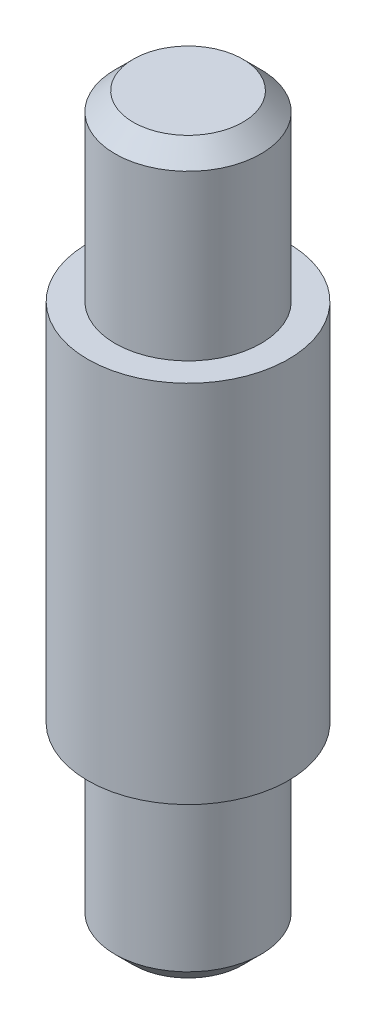
ISO-10303-21;
HEADER;
FILE_DESCRIPTION(('STEP AP214'),'2;1');
FILE_NAME('part.step','',(''),(''),'','','');
FILE_SCHEMA(('AUTOMOTIVE_DESIGN { 1 0 10303 214 1 1 1 1 }'));
ENDSEC;
DATA;
#1=APPLICATION_CONTEXT('core data for automotive mechanical design processes');
#2=APPLICATION_PROTOCOL_DEFINITION('international standard','automotive_design',2000,#1);
#3=PRODUCT_CONTEXT('',#1,'mechanical');
#4=PRODUCT('Part','Part','',(#3));
#5=PRODUCT_RELATED_PRODUCT_CATEGORY('part','',(#4));
#6=PRODUCT_DEFINITION_FORMATION('','',#4);
#7=PRODUCT_DEFINITION_CONTEXT('part definition',#1,'design');
#8=PRODUCT_DEFINITION('design','',#6,#7);
#9=PRODUCT_DEFINITION_SHAPE('','',#8);
#10=(LENGTH_UNIT() NAMED_UNIT(*) SI_UNIT(.MILLI.,.METRE.));
#11=(NAMED_UNIT(*) PLANE_ANGLE_UNIT() SI_UNIT($,.RADIAN.));
#12=(NAMED_UNIT(*) SI_UNIT($,.STERADIAN.) SOLID_ANGLE_UNIT());
#13=UNCERTAINTY_MEASURE_WITH_UNIT(LENGTH_MEASURE(1.E-05),#10,'distance_accuracy_value','');
#14=(GEOMETRIC_REPRESENTATION_CONTEXT(3) GLOBAL_UNCERTAINTY_ASSIGNED_CONTEXT((#13)) GLOBAL_UNIT_ASSIGNED_CONTEXT((#10,
#11,#12)) REPRESENTATION_CONTEXT('',''));
#15=CARTESIAN_POINT('',(0.,0.,0.));
#16=DIRECTION('',(0.,0.,1.));
#17=DIRECTION('',(1.,0.,0.));
#18=AXIS2_PLACEMENT_3D('',#15,#16,#17);
#19=CARTESIAN_POINT('',(0.,80.,0.));
#20=DIRECTION('',(0.,-1.,0.));
#21=DIRECTION('',(0.,0.,-1.));
#22=AXIS2_PLACEMENT_3D('',#19,#20,#21);
#23=CYLINDRICAL_SURFACE('',#22,8.);
#24=CARTESIAN_POINT('',(0.,78.,0.));
#25=DIRECTION('',(0.,1.,0.));
#26=DIRECTION('',(0.,0.,1.));
#27=AXIS2_PLACEMENT_3D('',#24,#25,#26);
#28=CIRCLE('',#27,8.);
#29=CARTESIAN_POINT('',(0.,78.,8.));
#30=VERTEX_POINT('',#29);
#31=EDGE_CURVE('E49',#30,#30,#28,.F.);
#32=ORIENTED_EDGE('',*,*,#31,.T.);
#33=EDGE_LOOP('',(#32));
#34=FACE_BOUND('',#33,.T.);
#35=CARTESIAN_POINT('',(0.,60.,0.));
#36=DIRECTION('',(0.,1.,0.));
#37=DIRECTION('',(0.,0.,1.));
#38=AXIS2_PLACEMENT_3D('',#35,#36,#37);
#39=CIRCLE('',#38,8.);
#40=CARTESIAN_POINT('',(0.,60.,8.));
#41=VERTEX_POINT('',#40);
#42=EDGE_CURVE('E59',#41,#41,#39,.T.);
#43=ORIENTED_EDGE('',*,*,#42,.T.);
#44=EDGE_LOOP('',(#43));
#45=FACE_BOUND('',#44,.T.);
#46=ADVANCED_FACE('F37',(#34,#45),#23,.T.);
#47=CARTESIAN_POINT('',(0.,80.,0.));
#48=DIRECTION('',(0.,1.,0.));
#49=DIRECTION('',(0.,0.,1.));
#50=AXIS2_PLACEMENT_3D('',#47,#48,#49);
#51=PLANE('',#50);
#52=CARTESIAN_POINT('',(0.,80.,0.));
#53=DIRECTION('',(0.,1.,0.));
#54=DIRECTION('',(0.,0.,1.));
#55=AXIS2_PLACEMENT_3D('',#52,#53,#54);
#56=CIRCLE('',#55,6.00000000000001);
#57=CARTESIAN_POINT('',(0.,80.,6.00000000000001));
#58=VERTEX_POINT('',#57);
#59=EDGE_CURVE('E53',#58,#58,#56,.T.);
#60=ORIENTED_EDGE('',*,*,#59,.T.);
#61=EDGE_LOOP('',(#60));
#62=FACE_BOUND('',#61,.T.);
#63=ADVANCED_FACE('F76',(#62),#51,.T.);
#64=CARTESIAN_POINT('',(0.,60.,0.));
#65=DIRECTION('',(0.,-1.,0.));
#66=DIRECTION('',(0.,0.,-1.));
#67=AXIS2_PLACEMENT_3D('',#64,#65,#66);
#68=CYLINDRICAL_SURFACE('',#67,11.);
#69=CARTESIAN_POINT('',(0.,60.,0.));
#70=DIRECTION('',(0.,1.,0.));
#71=DIRECTION('',(0.,0.,1.));
#72=AXIS2_PLACEMENT_3D('',#69,#70,#71);
#73=CIRCLE('',#72,11.);
#74=CARTESIAN_POINT('',(0.,60.,11.));
#75=VERTEX_POINT('',#74);
#76=EDGE_CURVE('E62',#75,#75,#73,.T.);
#77=ORIENTED_EDGE('',*,*,#76,.F.);
#78=EDGE_LOOP('',(#77));
#79=FACE_BOUND('',#78,.T.);
#80=CARTESIAN_POINT('',(0.,20.,0.));
#81=DIRECTION('',(0.,1.,0.));
#82=DIRECTION('',(0.,0.,1.));
#83=AXIS2_PLACEMENT_3D('',#80,#81,#82);
#84=CIRCLE('',#83,11.);
#85=CARTESIAN_POINT('',(0.,20.,11.));
#86=VERTEX_POINT('',#85);
#87=EDGE_CURVE('E65',#86,#86,#84,.T.);
#88=ORIENTED_EDGE('',*,*,#87,.T.);
#89=EDGE_LOOP('',(#88));
#90=FACE_BOUND('',#89,.T.);
#91=ADVANCED_FACE('F73',(#79,#90),#68,.T.);
#92=CARTESIAN_POINT('',(0.,60.,0.));
#93=DIRECTION('',(0.,1.,0.));
#94=DIRECTION('',(0.,0.,1.));
#95=AXIS2_PLACEMENT_3D('',#92,#93,#94);
#96=PLANE('',#95);
#97=ORIENTED_EDGE('',*,*,#42,.F.);
#98=EDGE_LOOP('',(#97));
#99=FACE_BOUND('',#98,.T.);
#100=ORIENTED_EDGE('',*,*,#76,.T.);
#101=EDGE_LOOP('',(#100));
#102=FACE_BOUND('',#101,.T.);
#103=ADVANCED_FACE('F71',(#99,#102),#96,.T.);
#104=CARTESIAN_POINT('',(0.,20.,0.));
#105=DIRECTION('',(0.,1.,0.));
#106=DIRECTION('',(0.,0.,1.));
#107=AXIS2_PLACEMENT_3D('',#104,#105,#106);
#108=PLANE('',#107);
#109=CARTESIAN_POINT('',(0.,20.,0.));
#110=DIRECTION('',(0.,1.,0.));
#111=DIRECTION('',(0.,0.,1.));
#112=AXIS2_PLACEMENT_3D('',#109,#110,#111);
#113=CIRCLE('',#112,8.);
#114=CARTESIAN_POINT('',(0.,20.,8.));
#115=VERTEX_POINT('',#114);
#116=EDGE_CURVE('E58',#115,#115,#113,.T.);
#117=ORIENTED_EDGE('',*,*,#116,.T.);
#118=EDGE_LOOP('',(#117));
#119=FACE_BOUND('',#118,.T.);
#120=ORIENTED_EDGE('',*,*,#87,.F.);
#121=EDGE_LOOP('',(#120));
#122=FACE_BOUND('',#121,.T.);
#123=ADVANCED_FACE('F80',(#119,#122),#108,.F.);
#124=CARTESIAN_POINT('',(0.,0.,0.));
#125=DIRECTION('',(0.,1.,0.));
#126=DIRECTION('',(0.,0.,1.));
#127=AXIS2_PLACEMENT_3D('',#124,#125,#126);
#128=PLANE('',#127);
#129=CARTESIAN_POINT('',(0.,0.,0.));
#130=DIRECTION('',(0.,1.,0.));
#131=DIRECTION('',(0.,0.,1.));
#132=AXIS2_PLACEMENT_3D('',#129,#130,#131);
#133=CIRCLE('',#132,6.);
#134=CARTESIAN_POINT('',(0.,0.,6.));
#135=VERTEX_POINT('',#134);
#136=EDGE_CURVE('E10',#135,#135,#133,.F.);
#137=ORIENTED_EDGE('',*,*,#136,.T.);
#138=EDGE_LOOP('',(#137));
#139=FACE_BOUND('',#138,.T.);
#140=ADVANCED_FACE('F82',(#139),#128,.F.);
#141=CARTESIAN_POINT('',(0.,1.99999999999999,0.));
#142=DIRECTION('',(0.,1.,0.));
#143=DIRECTION('',(0.,0.,1.));
#144=AXIS2_PLACEMENT_3D('',#141,#142,#143);
#145=CIRCLE('',#144,8.);
#146=CARTESIAN_POINT('',(0.,1.99999999999999,8.));
#147=VERTEX_POINT('',#146);
#148=EDGE_CURVE('E45',#147,#147,#145,.T.);
#149=ORIENTED_EDGE('',*,*,#148,.T.);
#150=EDGE_LOOP('',(#149));
#151=FACE_BOUND('',#150,.T.);
#152=ORIENTED_EDGE('',*,*,#116,.F.);
#153=EDGE_LOOP('',(#152));
#154=FACE_BOUND('',#153,.T.);
#155=ADVANCED_FACE('F89',(#151,#154),#23,.T.);
#156=CARTESIAN_POINT('',(0.,80.,0.));
#157=DIRECTION('',(0.,-1.,0.));
#158=DIRECTION('',(0.,0.,-1.));
#159=AXIS2_PLACEMENT_3D('',#156,#157,#158);
#160=CONICAL_SURFACE('',#159,6.00000000000001,0.78539816339745);
#161=ORIENTED_EDGE('',*,*,#31,.F.);
#162=EDGE_LOOP('',(#161));
#163=FACE_BOUND('',#162,.T.);
#164=ORIENTED_EDGE('',*,*,#59,.F.);
#165=EDGE_LOOP('',(#164));
#166=FACE_BOUND('',#165,.T.);
#167=ADVANCED_FACE('F103',(#163,#166),#160,.T.);
#168=CARTESIAN_POINT('',(0.,1.99999999999999,0.));
#169=DIRECTION('',(0.,1.,0.));
#170=DIRECTION('',(0.,0.,1.));
#171=AXIS2_PLACEMENT_3D('',#168,#169,#170);
#172=CONICAL_SURFACE('',#171,8.,0.785398163397452);
#173=ORIENTED_EDGE('',*,*,#136,.F.);
#174=EDGE_LOOP('',(#173));
#175=FACE_BOUND('',#174,.T.);
#176=ORIENTED_EDGE('',*,*,#148,.F.);
#177=EDGE_LOOP('',(#176));
#178=FACE_BOUND('',#177,.T.);
#179=ADVANCED_FACE('F40',(#175,#178),#172,.T.);
#180=CLOSED_SHELL('',(#46,#63,#91,#103,#123,#140,#155,#167,#179));
#181=MANIFOLD_SOLID_BREP('B2',#180);
#182=ADVANCED_BREP_SHAPE_REPRESENTATION('',(#18,#181),#14);
#183=SHAPE_DEFINITION_REPRESENTATION(#9,#182);
ENDSEC;
END-ISO-10303-21;
